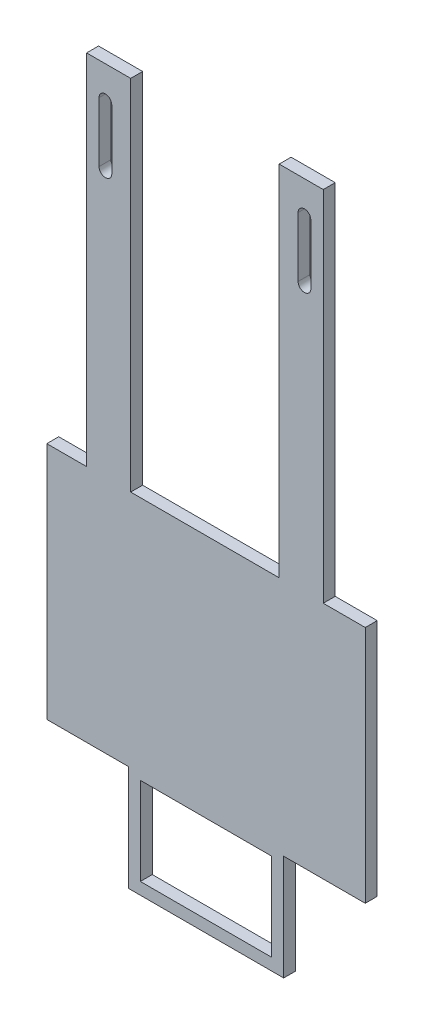
ISO-10303-21;
HEADER;
FILE_DESCRIPTION(('STEP AP214'),'2;1');
FILE_NAME('part.step','',(''),(''),'','','');
FILE_SCHEMA(('AUTOMOTIVE_DESIGN { 1 0 10303 214 1 1 1 1 }'));
ENDSEC;
DATA;
#1=APPLICATION_CONTEXT('core data for automotive mechanical design processes');
#2=APPLICATION_PROTOCOL_DEFINITION('international standard','automotive_design',2000,#1);
#3=PRODUCT_CONTEXT('',#1,'mechanical');
#4=PRODUCT('Part','Part','',(#3));
#5=PRODUCT_RELATED_PRODUCT_CATEGORY('part','',(#4));
#6=PRODUCT_DEFINITION_FORMATION('','',#4);
#7=PRODUCT_DEFINITION_CONTEXT('part definition',#1,'design');
#8=PRODUCT_DEFINITION('design','',#6,#7);
#9=PRODUCT_DEFINITION_SHAPE('','',#8);
#10=(LENGTH_UNIT() NAMED_UNIT(*) SI_UNIT(.MILLI.,.METRE.));
#11=(NAMED_UNIT(*) PLANE_ANGLE_UNIT() SI_UNIT($,.RADIAN.));
#12=(NAMED_UNIT(*) SI_UNIT($,.STERADIAN.) SOLID_ANGLE_UNIT());
#13=UNCERTAINTY_MEASURE_WITH_UNIT(LENGTH_MEASURE(1.E-05),#10,'distance_accuracy_value','');
#14=(GEOMETRIC_REPRESENTATION_CONTEXT(3) GLOBAL_UNCERTAINTY_ASSIGNED_CONTEXT((#13)) GLOBAL_UNIT_ASSIGNED_CONTEXT((#10,
#11,#12)) REPRESENTATION_CONTEXT('',''));
#15=CARTESIAN_POINT('',(0.,0.,0.));
#16=DIRECTION('',(0.,0.,1.));
#17=DIRECTION('',(1.,0.,0.));
#18=AXIS2_PLACEMENT_3D('',#15,#16,#17);
#19=CARTESIAN_POINT('',(0.,0.,3.));
#20=DIRECTION('',(0.,0.,-1.));
#21=DIRECTION('',(-1.,0.,0.));
#22=AXIS2_PLACEMENT_3D('',#19,#20,#21);
#23=PLANE('',#22);
#24=CARTESIAN_POINT('',(18.4511766992746,45.7315908599775,3.));
#25=DIRECTION('',(0.,0.,1.));
#26=DIRECTION('',(-1.,0.,0.));
#27=AXIS2_PLACEMENT_3D('',#24,#25,#26);
#28=CIRCLE('',#27,1.59999999999999);
#29=CARTESIAN_POINT('',(16.8511766992746,45.7315908599775,3.));
#30=VERTEX_POINT('',#29);
#31=CARTESIAN_POINT('',(20.0511766992746,45.7315908599775,3.));
#32=VERTEX_POINT('',#31);
#33=EDGE_CURVE('E279',#30,#32,#28,.T.);
#34=ORIENTED_EDGE('',*,*,#33,.F.);
#35=DIRECTION('',(0.,-1.,0.));
#36=VECTOR('',#35,1.);
#37=CARTESIAN_POINT('',(16.8511766992746,45.7315908599775,3.));
#38=LINE('',#37,#36);
#39=CARTESIAN_POINT('',(16.8511766992746,60.7315908599775,3.));
#40=VERTEX_POINT('',#39);
#41=EDGE_CURVE('E290',#40,#30,#38,.T.);
#42=ORIENTED_EDGE('',*,*,#41,.F.);
#43=CARTESIAN_POINT('',(18.4511766992746,60.7315908599775,3.));
#44=DIRECTION('',(0.,0.,1.));
#45=DIRECTION('',(-1.,0.,0.));
#46=AXIS2_PLACEMENT_3D('',#43,#44,#45);
#47=CIRCLE('',#46,1.6);
#48=CARTESIAN_POINT('',(20.0511766992746,60.7315908599775,3.));
#49=VERTEX_POINT('',#48);
#50=EDGE_CURVE('E286',#49,#40,#47,.T.);
#51=ORIENTED_EDGE('',*,*,#50,.F.);
#52=DIRECTION('',(0.,1.,0.));
#53=VECTOR('',#52,1.);
#54=CARTESIAN_POINT('',(20.0511766992746,45.7315908599775,3.));
#55=LINE('',#54,#53);
#56=EDGE_CURVE('E282',#32,#49,#55,.T.);
#57=ORIENTED_EDGE('',*,*,#56,.F.);
#58=EDGE_LOOP('',(#34,#42,#51,#57));
#59=FACE_BOUND('',#58,.T.);
#60=DIRECTION('',(1.,0.,0.));
#61=VECTOR('',#60,1.);
#62=CARTESIAN_POINT('',(13.227403860642,-81.1030863587574,3.));
#63=LINE('',#62,#61);
#64=CARTESIAN_POINT('',(13.227403860642,-81.1030863587574,3.));
#65=VERTEX_POINT('',#64);
#66=CARTESIAN_POINT('',(33.727403860642,-81.1030863587574,3.));
#67=VERTEX_POINT('',#66);
#68=EDGE_CURVE('E365',#65,#67,#63,.T.);
#69=ORIENTED_EDGE('',*,*,#68,.T.);
#70=DIRECTION('',(0.,1.,0.));
#71=VECTOR('',#70,1.);
#72=CARTESIAN_POINT('',(33.7274038606419,-21.1030863587574,3.));
#73=LINE('',#72,#71);
#74=CARTESIAN_POINT('',(33.7274038606419,-21.1030863587574,3.));
#75=VERTEX_POINT('',#74);
#76=EDGE_CURVE('E369',#67,#75,#73,.T.);
#77=ORIENTED_EDGE('',*,*,#76,.T.);
#78=DIRECTION('',(-1.,0.,0.));
#79=VECTOR('',#78,1.);
#80=CARTESIAN_POINT('',(23.1749495379073,-21.1030863587574,3.));
#81=LINE('',#80,#79);
#82=CARTESIAN_POINT('',(23.1749495379073,-21.1030863587574,3.));
#83=VERTEX_POINT('',#82);
#84=EDGE_CURVE('E373',#75,#83,#81,.T.);
#85=ORIENTED_EDGE('',*,*,#84,.T.);
#86=DIRECTION('',(0.,1.,0.));
#87=VECTOR('',#86,1.);
#88=CARTESIAN_POINT('',(23.1749495379073,68.8969136412426,3.));
#89=LINE('',#88,#87);
#90=CARTESIAN_POINT('',(23.1749495379073,68.8969136412426,3.));
#91=VERTEX_POINT('',#90);
#92=EDGE_CURVE('E376',#83,#91,#89,.T.);
#93=ORIENTED_EDGE('',*,*,#92,.T.);
#94=DIRECTION('',(-1.,0.,0.));
#95=VECTOR('',#94,1.);
#96=CARTESIAN_POINT('',(12.0979998474228,68.8969136412426,3.));
#97=LINE('',#96,#95);
#98=CARTESIAN_POINT('',(12.0979998474228,68.8969136412426,3.));
#99=VERTEX_POINT('',#98);
#100=EDGE_CURVE('E379',#91,#99,#97,.T.);
#101=ORIENTED_EDGE('',*,*,#100,.T.);
#102=DIRECTION('',(0.,-1.,0.));
#103=VECTOR('',#102,1.);
#104=CARTESIAN_POINT('',(12.0979998474228,68.8969136412426,3.));
#105=LINE('',#104,#103);
#106=CARTESIAN_POINT('',(12.0979998474228,-21.1030863587574,3.));
#107=VERTEX_POINT('',#106);
#108=EDGE_CURVE('E382',#99,#107,#105,.T.);
#109=ORIENTED_EDGE('',*,*,#108,.T.);
#110=DIRECTION('',(-1.,0.,0.));
#111=VECTOR('',#110,1.);
#112=CARTESIAN_POINT('',(-25.1956464488736,-21.1030863587574,3.));
#113=LINE('',#112,#111);
#114=CARTESIAN_POINT('',(-25.1956464488736,-21.1030863587574,3.));
#115=VERTEX_POINT('',#114);
#116=EDGE_CURVE('E385',#107,#115,#113,.T.);
#117=ORIENTED_EDGE('',*,*,#116,.T.);
#118=DIRECTION('',(0.,1.,0.));
#119=VECTOR('',#118,1.);
#120=CARTESIAN_POINT('',(-25.1956464488736,68.8969136412426,3.));
#121=LINE('',#120,#119);
#122=CARTESIAN_POINT('',(-25.1956464488736,68.8969136412426,3.));
#123=VERTEX_POINT('',#122);
#124=EDGE_CURVE('E388',#115,#123,#121,.T.);
#125=ORIENTED_EDGE('',*,*,#124,.T.);
#126=DIRECTION('',(-1.,0.,0.));
#127=VECTOR('',#126,1.);
#128=CARTESIAN_POINT('',(-36.2725961393581,68.8969136412426,3.));
#129=LINE('',#128,#127);
#130=CARTESIAN_POINT('',(-36.2725961393581,68.8969136412426,3.));
#131=VERTEX_POINT('',#130);
#132=EDGE_CURVE('E391',#123,#131,#129,.T.);
#133=ORIENTED_EDGE('',*,*,#132,.T.);
#134=DIRECTION('',(0.,-1.,0.));
#135=VECTOR('',#134,1.);
#136=CARTESIAN_POINT('',(-36.2725961393581,68.8969136412426,3.));
#137=LINE('',#136,#135);
#138=CARTESIAN_POINT('',(-36.2725961393581,-21.1030863587574,3.));
#139=VERTEX_POINT('',#138);
#140=EDGE_CURVE('E394',#131,#139,#137,.T.);
#141=ORIENTED_EDGE('',*,*,#140,.T.);
#142=DIRECTION('',(-1.,0.,0.));
#143=VECTOR('',#142,1.);
#144=CARTESIAN_POINT('',(-36.2725961393581,-21.1030863587574,3.));
#145=LINE('',#144,#143);
#146=CARTESIAN_POINT('',(-46.2725961393581,-21.1030863587574,3.));
#147=VERTEX_POINT('',#146);
#148=EDGE_CURVE('E397',#139,#147,#145,.T.);
#149=ORIENTED_EDGE('',*,*,#148,.T.);
#150=DIRECTION('',(0.,-1.,0.));
#151=VECTOR('',#150,1.);
#152=CARTESIAN_POINT('',(-46.2725961393581,-21.1030863587574,3.));
#153=LINE('',#152,#151);
#154=CARTESIAN_POINT('',(-46.272596139358,-81.1030863587574,3.));
#155=VERTEX_POINT('',#154);
#156=EDGE_CURVE('E400',#147,#155,#153,.T.);
#157=ORIENTED_EDGE('',*,*,#156,.T.);
#158=DIRECTION('',(1.,0.,0.));
#159=VECTOR('',#158,1.);
#160=CARTESIAN_POINT('',(-46.272596139358,-81.1030863587574,3.));
#161=LINE('',#160,#159);
#162=CARTESIAN_POINT('',(-25.772596139358,-81.1030863587574,3.));
#163=VERTEX_POINT('',#162);
#164=EDGE_CURVE('E403',#155,#163,#161,.T.);
#165=ORIENTED_EDGE('',*,*,#164,.T.);
#166=DIRECTION('',(0.,-1.,0.));
#167=VECTOR('',#166,1.);
#168=CARTESIAN_POINT('',(-25.772596139358,-81.1030863587574,3.));
#169=LINE('',#168,#167);
#170=CARTESIAN_POINT('',(-25.772596139358,-107.603086358757,3.));
#171=VERTEX_POINT('',#170);
#172=EDGE_CURVE('E406',#163,#171,#169,.T.);
#173=ORIENTED_EDGE('',*,*,#172,.T.);
#174=DIRECTION('',(1.,0.,0.));
#175=VECTOR('',#174,1.);
#176=CARTESIAN_POINT('',(-25.772596139358,-107.603086358757,3.));
#177=LINE('',#176,#175);
#178=CARTESIAN_POINT('',(13.227403860642,-107.603086358757,3.));
#179=VERTEX_POINT('',#178);
#180=EDGE_CURVE('E409',#171,#179,#177,.T.);
#181=ORIENTED_EDGE('',*,*,#180,.T.);
#182=DIRECTION('',(0.,1.,0.));
#183=VECTOR('',#182,1.);
#184=CARTESIAN_POINT('',(13.227403860642,-81.1030863587574,3.));
#185=LINE('',#184,#183);
#186=EDGE_CURVE('E412',#179,#65,#185,.T.);
#187=ORIENTED_EDGE('',*,*,#186,.T.);
#188=EDGE_LOOP('',(#69,#77,#85,#93,#101,#109,#117,#125,#133,#141,#149,#157,#165,#173,#181,#187));
#189=FACE_BOUND('',#188,.T.);
#190=CARTESIAN_POINT('',(-31.5488233007254,45.7315908599775,3.));
#191=DIRECTION('',(0.,0.,1.));
#192=DIRECTION('',(1.,0.,0.));
#193=AXIS2_PLACEMENT_3D('',#190,#191,#192);
#194=CIRCLE('',#193,1.59999999999999);
#195=CARTESIAN_POINT('',(-33.1488233007254,45.7315908599775,3.));
#196=VERTEX_POINT('',#195);
#197=CARTESIAN_POINT('',(-29.9488233007254,45.7315908599775,3.));
#198=VERTEX_POINT('',#197);
#199=EDGE_CURVE('E322',#196,#198,#194,.T.);
#200=ORIENTED_EDGE('',*,*,#199,.F.);
#201=DIRECTION('',(0.,-1.,0.));
#202=VECTOR('',#201,1.);
#203=CARTESIAN_POINT('',(-33.1488233007254,45.7315908599775,3.));
#204=LINE('',#203,#202);
#205=CARTESIAN_POINT('',(-33.1488233007254,60.7315908599775,3.));
#206=VERTEX_POINT('',#205);
#207=EDGE_CURVE('E333',#206,#196,#204,.T.);
#208=ORIENTED_EDGE('',*,*,#207,.F.);
#209=CARTESIAN_POINT('',(-31.5488233007254,60.7315908599775,3.));
#210=DIRECTION('',(0.,0.,1.));
#211=DIRECTION('',(1.,0.,0.));
#212=AXIS2_PLACEMENT_3D('',#209,#210,#211);
#213=CIRCLE('',#212,1.6);
#214=CARTESIAN_POINT('',(-29.9488233007254,60.7315908599775,3.));
#215=VERTEX_POINT('',#214);
#216=EDGE_CURVE('E329',#215,#206,#213,.T.);
#217=ORIENTED_EDGE('',*,*,#216,.F.);
#218=DIRECTION('',(0.,1.,0.));
#219=VECTOR('',#218,1.);
#220=CARTESIAN_POINT('',(-29.9488233007254,45.7315908599775,3.));
#221=LINE('',#220,#219);
#222=EDGE_CURVE('E325',#198,#215,#221,.T.);
#223=ORIENTED_EDGE('',*,*,#222,.F.);
#224=EDGE_LOOP('',(#200,#208,#217,#223));
#225=FACE_BOUND('',#224,.T.);
#226=DIRECTION('',(-1.,0.,0.));
#227=VECTOR('',#226,1.);
#228=CARTESIAN_POINT('',(-22.772596139358,-82.6030863587574,3.));
#229=LINE('',#228,#227);
#230=CARTESIAN_POINT('',(10.227403860642,-82.6030863587574,3.));
#231=VERTEX_POINT('',#230);
#232=CARTESIAN_POINT('',(-22.772596139358,-82.6030863587574,3.));
#233=VERTEX_POINT('',#232);
#234=EDGE_CURVE('E231',#231,#233,#229,.T.);
#235=ORIENTED_EDGE('',*,*,#234,.F.);
#236=DIRECTION('',(0.,1.,0.));
#237=VECTOR('',#236,1.);
#238=CARTESIAN_POINT('',(10.227403860642,-82.6030863587574,3.));
#239=LINE('',#238,#237);
#240=CARTESIAN_POINT('',(10.227403860642,-104.603086358757,3.));
#241=VERTEX_POINT('',#240);
#242=EDGE_CURVE('E257',#241,#231,#239,.T.);
#243=ORIENTED_EDGE('',*,*,#242,.F.);
#244=DIRECTION('',(1.,0.,0.));
#245=VECTOR('',#244,1.);
#246=CARTESIAN_POINT('',(-22.772596139358,-104.603086358757,3.));
#247=LINE('',#246,#245);
#248=CARTESIAN_POINT('',(-22.772596139358,-104.603086358757,3.));
#249=VERTEX_POINT('',#248);
#250=EDGE_CURVE('E253',#249,#241,#247,.T.);
#251=ORIENTED_EDGE('',*,*,#250,.F.);
#252=DIRECTION('',(0.,-1.,0.));
#253=VECTOR('',#252,1.);
#254=CARTESIAN_POINT('',(-22.772596139358,-82.6030863587574,3.));
#255=LINE('',#254,#253);
#256=EDGE_CURVE('E240',#233,#249,#255,.T.);
#257=ORIENTED_EDGE('',*,*,#256,.F.);
#258=EDGE_LOOP('',(#235,#243,#251,#257));
#259=FACE_BOUND('',#258,.T.);
#260=ADVANCED_FACE('F45',(#59,#189,#225,#259),#23,.F.);
#261=CARTESIAN_POINT('',(0.,0.,0.));
#262=DIRECTION('',(0.,0.,-1.));
#263=DIRECTION('',(-1.,0.,0.));
#264=AXIS2_PLACEMENT_3D('',#261,#262,#263);
#265=PLANE('',#264);
#266=DIRECTION('',(1.,0.,0.));
#267=VECTOR('',#266,1.);
#268=CARTESIAN_POINT('',(13.227403860642,-81.1030863587574,0.));
#269=LINE('',#268,#267);
#270=CARTESIAN_POINT('',(13.227403860642,-81.1030863587574,0.));
#271=VERTEX_POINT('',#270);
#272=CARTESIAN_POINT('',(33.727403860642,-81.1030863587574,0.));
#273=VERTEX_POINT('',#272);
#274=EDGE_CURVE('E364',#271,#273,#269,.T.);
#275=ORIENTED_EDGE('',*,*,#274,.F.);
#276=DIRECTION('',(0.,1.,0.));
#277=VECTOR('',#276,1.);
#278=CARTESIAN_POINT('',(13.227403860642,-81.1030863587574,0.));
#279=LINE('',#278,#277);
#280=CARTESIAN_POINT('',(13.227403860642,-107.603086358757,0.));
#281=VERTEX_POINT('',#280);
#282=EDGE_CURVE('E370',#281,#271,#279,.T.);
#283=ORIENTED_EDGE('',*,*,#282,.F.);
#284=DIRECTION('',(1.,0.,0.));
#285=VECTOR('',#284,1.);
#286=CARTESIAN_POINT('',(-25.772596139358,-107.603086358757,0.));
#287=LINE('',#286,#285);
#288=CARTESIAN_POINT('',(-25.772596139358,-107.603086358757,0.));
#289=VERTEX_POINT('',#288);
#290=EDGE_CURVE('E458',#289,#281,#287,.T.);
#291=ORIENTED_EDGE('',*,*,#290,.F.);
#292=DIRECTION('',(0.,-1.,0.));
#293=VECTOR('',#292,1.);
#294=CARTESIAN_POINT('',(-25.772596139358,-81.1030863587574,0.));
#295=LINE('',#294,#293);
#296=CARTESIAN_POINT('',(-25.772596139358,-81.1030863587574,0.));
#297=VERTEX_POINT('',#296);
#298=EDGE_CURVE('E455',#297,#289,#295,.T.);
#299=ORIENTED_EDGE('',*,*,#298,.F.);
#300=DIRECTION('',(1.,0.,0.));
#301=VECTOR('',#300,1.);
#302=CARTESIAN_POINT('',(-46.272596139358,-81.1030863587574,0.));
#303=LINE('',#302,#301);
#304=CARTESIAN_POINT('',(-46.272596139358,-81.1030863587574,0.));
#305=VERTEX_POINT('',#304);
#306=EDGE_CURVE('E452',#305,#297,#303,.T.);
#307=ORIENTED_EDGE('',*,*,#306,.F.);
#308=DIRECTION('',(0.,-1.,0.));
#309=VECTOR('',#308,1.);
#310=CARTESIAN_POINT('',(-46.2725961393581,-21.1030863587574,0.));
#311=LINE('',#310,#309);
#312=CARTESIAN_POINT('',(-46.2725961393581,-21.1030863587574,0.));
#313=VERTEX_POINT('',#312);
#314=EDGE_CURVE('E449',#313,#305,#311,.T.);
#315=ORIENTED_EDGE('',*,*,#314,.F.);
#316=DIRECTION('',(-1.,0.,0.));
#317=VECTOR('',#316,1.);
#318=CARTESIAN_POINT('',(-36.2725961393581,-21.1030863587574,0.));
#319=LINE('',#318,#317);
#320=CARTESIAN_POINT('',(-36.2725961393581,-21.1030863587574,0.));
#321=VERTEX_POINT('',#320);
#322=EDGE_CURVE('E446',#321,#313,#319,.T.);
#323=ORIENTED_EDGE('',*,*,#322,.F.);
#324=DIRECTION('',(0.,-1.,0.));
#325=VECTOR('',#324,1.);
#326=CARTESIAN_POINT('',(-36.2725961393581,68.8969136412426,0.));
#327=LINE('',#326,#325);
#328=CARTESIAN_POINT('',(-36.2725961393581,68.8969136412426,0.));
#329=VERTEX_POINT('',#328);
#330=EDGE_CURVE('E443',#329,#321,#327,.T.);
#331=ORIENTED_EDGE('',*,*,#330,.F.);
#332=DIRECTION('',(-1.,0.,0.));
#333=VECTOR('',#332,1.);
#334=CARTESIAN_POINT('',(-36.2725961393581,68.8969136412426,0.));
#335=LINE('',#334,#333);
#336=CARTESIAN_POINT('',(-25.1956464488736,68.8969136412426,0.));
#337=VERTEX_POINT('',#336);
#338=EDGE_CURVE('E440',#337,#329,#335,.T.);
#339=ORIENTED_EDGE('',*,*,#338,.F.);
#340=DIRECTION('',(0.,1.,0.));
#341=VECTOR('',#340,1.);
#342=CARTESIAN_POINT('',(-25.1956464488736,68.8969136412426,0.));
#343=LINE('',#342,#341);
#344=CARTESIAN_POINT('',(-25.1956464488736,-21.1030863587574,0.));
#345=VERTEX_POINT('',#344);
#346=EDGE_CURVE('E437',#345,#337,#343,.T.);
#347=ORIENTED_EDGE('',*,*,#346,.F.);
#348=DIRECTION('',(-1.,0.,0.));
#349=VECTOR('',#348,1.);
#350=CARTESIAN_POINT('',(-25.1956464488736,-21.1030863587574,0.));
#351=LINE('',#350,#349);
#352=CARTESIAN_POINT('',(12.0979998474228,-21.1030863587574,0.));
#353=VERTEX_POINT('',#352);
#354=EDGE_CURVE('E434',#353,#345,#351,.T.);
#355=ORIENTED_EDGE('',*,*,#354,.F.);
#356=DIRECTION('',(0.,-1.,0.));
#357=VECTOR('',#356,1.);
#358=CARTESIAN_POINT('',(12.0979998474228,68.8969136412426,0.));
#359=LINE('',#358,#357);
#360=CARTESIAN_POINT('',(12.0979998474228,68.8969136412426,0.));
#361=VERTEX_POINT('',#360);
#362=EDGE_CURVE('E431',#361,#353,#359,.T.);
#363=ORIENTED_EDGE('',*,*,#362,.F.);
#364=DIRECTION('',(-1.,0.,0.));
#365=VECTOR('',#364,1.);
#366=CARTESIAN_POINT('',(12.0979998474228,68.8969136412426,0.));
#367=LINE('',#366,#365);
#368=CARTESIAN_POINT('',(23.1749495379073,68.8969136412426,0.));
#369=VERTEX_POINT('',#368);
#370=EDGE_CURVE('E428',#369,#361,#367,.T.);
#371=ORIENTED_EDGE('',*,*,#370,.F.);
#372=DIRECTION('',(0.,1.,0.));
#373=VECTOR('',#372,1.);
#374=CARTESIAN_POINT('',(23.1749495379073,68.8969136412426,0.));
#375=LINE('',#374,#373);
#376=CARTESIAN_POINT('',(23.1749495379073,-21.1030863587574,0.));
#377=VERTEX_POINT('',#376);
#378=EDGE_CURVE('E425',#377,#369,#375,.T.);
#379=ORIENTED_EDGE('',*,*,#378,.F.);
#380=DIRECTION('',(-1.,0.,0.));
#381=VECTOR('',#380,1.);
#382=CARTESIAN_POINT('',(23.1749495379073,-21.1030863587574,0.));
#383=LINE('',#382,#381);
#384=CARTESIAN_POINT('',(33.7274038606419,-21.1030863587574,0.));
#385=VERTEX_POINT('',#384);
#386=EDGE_CURVE('E422',#385,#377,#383,.T.);
#387=ORIENTED_EDGE('',*,*,#386,.F.);
#388=DIRECTION('',(0.,1.,0.));
#389=VECTOR('',#388,1.);
#390=CARTESIAN_POINT('',(33.7274038606419,-21.1030863587574,0.));
#391=LINE('',#390,#389);
#392=EDGE_CURVE('E419',#273,#385,#391,.T.);
#393=ORIENTED_EDGE('',*,*,#392,.F.);
#394=EDGE_LOOP('',(#275,#283,#291,#299,#307,#315,#323,#331,#339,#347,#355,#363,#371,#379,#387,#393));
#395=FACE_BOUND('',#394,.T.);
#396=DIRECTION('',(0.,-1.,0.));
#397=VECTOR('',#396,1.);
#398=CARTESIAN_POINT('',(-33.1488233007254,45.7315908599775,0.));
#399=LINE('',#398,#397);
#400=CARTESIAN_POINT('',(-33.1488233007254,60.7315908599775,0.));
#401=VERTEX_POINT('',#400);
#402=CARTESIAN_POINT('',(-33.1488233007254,45.7315908599775,0.));
#403=VERTEX_POINT('',#402);
#404=EDGE_CURVE('E326',#401,#403,#399,.T.);
#405=ORIENTED_EDGE('',*,*,#404,.T.);
#406=CARTESIAN_POINT('',(-31.5488233007254,45.7315908599775,0.));
#407=DIRECTION('',(0.,0.,1.));
#408=DIRECTION('',(1.,0.,0.));
#409=AXIS2_PLACEMENT_3D('',#406,#407,#408);
#410=CIRCLE('',#409,1.59999999999999);
#411=CARTESIAN_POINT('',(-29.9488233007254,45.7315908599775,0.));
#412=VERTEX_POINT('',#411);
#413=EDGE_CURVE('E321',#403,#412,#410,.T.);
#414=ORIENTED_EDGE('',*,*,#413,.T.);
#415=DIRECTION('',(0.,1.,0.));
#416=VECTOR('',#415,1.);
#417=CARTESIAN_POINT('',(-29.9488233007254,45.7315908599775,0.));
#418=LINE('',#417,#416);
#419=CARTESIAN_POINT('',(-29.9488233007254,60.7315908599775,0.));
#420=VERTEX_POINT('',#419);
#421=EDGE_CURVE('E340',#412,#420,#418,.T.);
#422=ORIENTED_EDGE('',*,*,#421,.T.);
#423=CARTESIAN_POINT('',(-31.5488233007254,60.7315908599775,0.));
#424=DIRECTION('',(0.,0.,1.));
#425=DIRECTION('',(1.,0.,0.));
#426=AXIS2_PLACEMENT_3D('',#423,#424,#425);
#427=CIRCLE('',#426,1.6);
#428=EDGE_CURVE('E344',#420,#401,#427,.T.);
#429=ORIENTED_EDGE('',*,*,#428,.T.);
#430=EDGE_LOOP('',(#405,#414,#422,#429));
#431=FACE_BOUND('',#430,.T.);
#432=DIRECTION('',(0.,-1.,0.));
#433=VECTOR('',#432,1.);
#434=CARTESIAN_POINT('',(16.8511766992746,45.7315908599775,0.));
#435=LINE('',#434,#433);
#436=CARTESIAN_POINT('',(16.8511766992746,60.7315908599775,0.));
#437=VERTEX_POINT('',#436);
#438=CARTESIAN_POINT('',(16.8511766992746,45.7315908599775,0.));
#439=VERTEX_POINT('',#438);
#440=EDGE_CURVE('E283',#437,#439,#435,.T.);
#441=ORIENTED_EDGE('',*,*,#440,.T.);
#442=CARTESIAN_POINT('',(18.4511766992746,45.7315908599775,0.));
#443=DIRECTION('',(0.,0.,1.));
#444=DIRECTION('',(-1.,0.,0.));
#445=AXIS2_PLACEMENT_3D('',#442,#443,#444);
#446=CIRCLE('',#445,1.59999999999999);
#447=CARTESIAN_POINT('',(20.0511766992746,45.7315908599775,0.));
#448=VERTEX_POINT('',#447);
#449=EDGE_CURVE('E249',#439,#448,#446,.T.);
#450=ORIENTED_EDGE('',*,*,#449,.T.);
#451=DIRECTION('',(0.,1.,0.));
#452=VECTOR('',#451,1.);
#453=CARTESIAN_POINT('',(20.0511766992746,45.7315908599775,0.));
#454=LINE('',#453,#452);
#455=CARTESIAN_POINT('',(20.0511766992746,60.7315908599775,0.));
#456=VERTEX_POINT('',#455);
#457=EDGE_CURVE('E297',#448,#456,#454,.T.);
#458=ORIENTED_EDGE('',*,*,#457,.T.);
#459=CARTESIAN_POINT('',(18.4511766992746,60.7315908599775,0.));
#460=DIRECTION('',(0.,0.,1.));
#461=DIRECTION('',(-1.,0.,0.));
#462=AXIS2_PLACEMENT_3D('',#459,#460,#461);
#463=CIRCLE('',#462,1.6);
#464=EDGE_CURVE('E301',#456,#437,#463,.T.);
#465=ORIENTED_EDGE('',*,*,#464,.T.);
#466=EDGE_LOOP('',(#441,#450,#458,#465));
#467=FACE_BOUND('',#466,.T.);
#468=DIRECTION('',(0.,1.,0.));
#469=VECTOR('',#468,1.);
#470=CARTESIAN_POINT('',(10.227403860642,-82.6030863587574,0.));
#471=LINE('',#470,#469);
#472=CARTESIAN_POINT('',(10.227403860642,-104.603086358757,0.));
#473=VERTEX_POINT('',#472);
#474=CARTESIAN_POINT('',(10.227403860642,-82.6030863587574,0.));
#475=VERTEX_POINT('',#474);
#476=EDGE_CURVE('E241',#473,#475,#471,.T.);
#477=ORIENTED_EDGE('',*,*,#476,.T.);
#478=DIRECTION('',(-1.,0.,0.));
#479=VECTOR('',#478,1.);
#480=CARTESIAN_POINT('',(-22.772596139358,-82.6030863587574,0.));
#481=LINE('',#480,#479);
#482=CARTESIAN_POINT('',(-22.772596139358,-82.6030863587574,0.));
#483=VERTEX_POINT('',#482);
#484=EDGE_CURVE('E69',#475,#483,#481,.T.);
#485=ORIENTED_EDGE('',*,*,#484,.T.);
#486=DIRECTION('',(0.,-1.,0.));
#487=VECTOR('',#486,1.);
#488=CARTESIAN_POINT('',(-22.772596139358,-82.6030863587574,0.));
#489=LINE('',#488,#487);
#490=CARTESIAN_POINT('',(-22.772596139358,-104.603086358757,0.));
#491=VERTEX_POINT('',#490);
#492=EDGE_CURVE('E247',#483,#491,#489,.T.);
#493=ORIENTED_EDGE('',*,*,#492,.T.);
#494=DIRECTION('',(1.,0.,0.));
#495=VECTOR('',#494,1.);
#496=CARTESIAN_POINT('',(-22.772596139358,-104.603086358757,0.));
#497=LINE('',#496,#495);
#498=EDGE_CURVE('E266',#491,#473,#497,.T.);
#499=ORIENTED_EDGE('',*,*,#498,.T.);
#500=EDGE_LOOP('',(#477,#485,#493,#499));
#501=FACE_BOUND('',#500,.T.);
#502=ADVANCED_FACE('F529',(#395,#431,#467,#501),#265,.T.);
#503=CARTESIAN_POINT('',(13.227403860642,-81.1030863587574,3.));
#504=DIRECTION('',(0.,1.,0.));
#505=DIRECTION('',(0.,0.,1.));
#506=AXIS2_PLACEMENT_3D('',#503,#504,#505);
#507=PLANE('',#506);
#508=ORIENTED_EDGE('',*,*,#274,.T.);
#509=DIRECTION('',(0.,0.,-1.));
#510=VECTOR('',#509,1.);
#511=CARTESIAN_POINT('',(33.727403860642,-81.1030863587574,3.));
#512=LINE('',#511,#510);
#513=EDGE_CURVE('E11',#67,#273,#512,.T.);
#514=ORIENTED_EDGE('',*,*,#513,.F.);
#515=ORIENTED_EDGE('',*,*,#68,.F.);
#516=DIRECTION('',(0.,0.,-1.));
#517=VECTOR('',#516,1.);
#518=CARTESIAN_POINT('',(13.227403860642,-81.1030863587574,3.));
#519=LINE('',#518,#517);
#520=EDGE_CURVE('E415',#65,#271,#519,.T.);
#521=ORIENTED_EDGE('',*,*,#520,.T.);
#522=EDGE_LOOP('',(#508,#514,#515,#521));
#523=FACE_BOUND('',#522,.T.);
#524=ADVANCED_FACE('F47',(#523),#507,.F.);
#525=CARTESIAN_POINT('',(33.7274038606419,-21.1030863587574,3.));
#526=DIRECTION('',(-1.,0.,0.));
#527=DIRECTION('',(0.,-1.,0.));
#528=AXIS2_PLACEMENT_3D('',#525,#526,#527);
#529=PLANE('',#528);
#530=ORIENTED_EDGE('',*,*,#392,.T.);
#531=DIRECTION('',(0.,0.,-1.));
#532=VECTOR('',#531,1.);
#533=CARTESIAN_POINT('',(33.7274038606419,-21.1030863587574,3.));
#534=LINE('',#533,#532);
#535=EDGE_CURVE('E54',#75,#385,#534,.T.);
#536=ORIENTED_EDGE('',*,*,#535,.F.);
#537=ORIENTED_EDGE('',*,*,#76,.F.);
#538=ORIENTED_EDGE('',*,*,#513,.T.);
#539=EDGE_LOOP('',(#530,#536,#537,#538));
#540=FACE_BOUND('',#539,.T.);
#541=ADVANCED_FACE('F547',(#540),#529,.F.);
#542=CARTESIAN_POINT('',(23.1749495379073,-21.1030863587574,3.));
#543=DIRECTION('',(0.,-1.,0.));
#544=DIRECTION('',(1.,0.,0.));
#545=AXIS2_PLACEMENT_3D('',#542,#543,#544);
#546=PLANE('',#545);
#547=ORIENTED_EDGE('',*,*,#386,.T.);
#548=DIRECTION('',(0.,0.,-1.));
#549=VECTOR('',#548,1.);
#550=CARTESIAN_POINT('',(23.1749495379073,-21.1030863587574,3.));
#551=LINE('',#550,#549);
#552=EDGE_CURVE('E514',#83,#377,#551,.T.);
#553=ORIENTED_EDGE('',*,*,#552,.F.);
#554=ORIENTED_EDGE('',*,*,#84,.F.);
#555=ORIENTED_EDGE('',*,*,#535,.T.);
#556=EDGE_LOOP('',(#547,#553,#554,#555));
#557=FACE_BOUND('',#556,.T.);
#558=ADVANCED_FACE('F523',(#557),#546,.F.);
#559=CARTESIAN_POINT('',(23.1749495379073,68.8969136412426,3.));
#560=DIRECTION('',(-1.,0.,0.));
#561=DIRECTION('',(0.,0.,1.));
#562=AXIS2_PLACEMENT_3D('',#559,#560,#561);
#563=PLANE('',#562);
#564=ORIENTED_EDGE('',*,*,#378,.T.);
#565=DIRECTION('',(0.,0.,-1.));
#566=VECTOR('',#565,1.);
#567=CARTESIAN_POINT('',(23.1749495379073,68.8969136412426,3.));
#568=LINE('',#567,#566);
#569=EDGE_CURVE('E510',#91,#369,#568,.T.);
#570=ORIENTED_EDGE('',*,*,#569,.F.);
#571=ORIENTED_EDGE('',*,*,#92,.F.);
#572=ORIENTED_EDGE('',*,*,#552,.T.);
#573=EDGE_LOOP('',(#564,#570,#571,#572));
#574=FACE_BOUND('',#573,.T.);
#575=ADVANCED_FACE('F535',(#574),#563,.F.);
#576=CARTESIAN_POINT('',(12.0979998474228,68.8969136412426,3.));
#577=DIRECTION('',(0.,-1.,0.));
#578=DIRECTION('',(1.,0.,0.));
#579=AXIS2_PLACEMENT_3D('',#576,#577,#578);
#580=PLANE('',#579);
#581=ORIENTED_EDGE('',*,*,#370,.T.);
#582=DIRECTION('',(0.,0.,-1.));
#583=VECTOR('',#582,1.);
#584=CARTESIAN_POINT('',(12.0979998474228,68.8969136412426,3.));
#585=LINE('',#584,#583);
#586=EDGE_CURVE('E506',#99,#361,#585,.T.);
#587=ORIENTED_EDGE('',*,*,#586,.F.);
#588=ORIENTED_EDGE('',*,*,#100,.F.);
#589=ORIENTED_EDGE('',*,*,#569,.T.);
#590=EDGE_LOOP('',(#581,#587,#588,#589));
#591=FACE_BOUND('',#590,.T.);
#592=ADVANCED_FACE('F539',(#591),#580,.F.);
#593=CARTESIAN_POINT('',(12.0979998474228,68.8969136412426,3.));
#594=DIRECTION('',(1.,0.,0.));
#595=DIRECTION('',(0.,1.,0.));
#596=AXIS2_PLACEMENT_3D('',#593,#594,#595);
#597=PLANE('',#596);
#598=ORIENTED_EDGE('',*,*,#362,.T.);
#599=DIRECTION('',(0.,0.,-1.));
#600=VECTOR('',#599,1.);
#601=CARTESIAN_POINT('',(12.0979998474228,-21.1030863587574,3.));
#602=LINE('',#601,#600);
#603=EDGE_CURVE('E502',#107,#353,#602,.T.);
#604=ORIENTED_EDGE('',*,*,#603,.F.);
#605=ORIENTED_EDGE('',*,*,#108,.F.);
#606=ORIENTED_EDGE('',*,*,#586,.T.);
#607=EDGE_LOOP('',(#598,#604,#605,#606));
#608=FACE_BOUND('',#607,.T.);
#609=ADVANCED_FACE('F600',(#608),#597,.F.);
#610=CARTESIAN_POINT('',(-25.1956464488736,-21.1030863587574,3.));
#611=DIRECTION('',(0.,-1.,0.));
#612=DIRECTION('',(1.,0.,0.));
#613=AXIS2_PLACEMENT_3D('',#610,#611,#612);
#614=PLANE('',#613);
#615=ORIENTED_EDGE('',*,*,#354,.T.);
#616=DIRECTION('',(0.,0.,-1.));
#617=VECTOR('',#616,1.);
#618=CARTESIAN_POINT('',(-25.1956464488736,-21.1030863587574,3.));
#619=LINE('',#618,#617);
#620=EDGE_CURVE('E498',#115,#345,#619,.T.);
#621=ORIENTED_EDGE('',*,*,#620,.F.);
#622=ORIENTED_EDGE('',*,*,#116,.F.);
#623=ORIENTED_EDGE('',*,*,#603,.T.);
#624=EDGE_LOOP('',(#615,#621,#622,#623));
#625=FACE_BOUND('',#624,.T.);
#626=ADVANCED_FACE('F597',(#625),#614,.F.);
#627=CARTESIAN_POINT('',(-25.1956464488736,68.8969136412426,3.));
#628=DIRECTION('',(-1.,0.,0.));
#629=DIRECTION('',(0.,-1.,0.));
#630=AXIS2_PLACEMENT_3D('',#627,#628,#629);
#631=PLANE('',#630);
#632=ORIENTED_EDGE('',*,*,#346,.T.);
#633=DIRECTION('',(0.,0.,-1.));
#634=VECTOR('',#633,1.);
#635=CARTESIAN_POINT('',(-25.1956464488736,68.8969136412426,3.));
#636=LINE('',#635,#634);
#637=EDGE_CURVE('E494',#123,#337,#636,.T.);
#638=ORIENTED_EDGE('',*,*,#637,.F.);
#639=ORIENTED_EDGE('',*,*,#124,.F.);
#640=ORIENTED_EDGE('',*,*,#620,.T.);
#641=EDGE_LOOP('',(#632,#638,#639,#640));
#642=FACE_BOUND('',#641,.T.);
#643=ADVANCED_FACE('F593',(#642),#631,.F.);
#644=CARTESIAN_POINT('',(-36.2725961393581,68.8969136412426,3.));
#645=DIRECTION('',(0.,-1.,0.));
#646=DIRECTION('',(0.,0.,-1.));
#647=AXIS2_PLACEMENT_3D('',#644,#645,#646);
#648=PLANE('',#647);
#649=ORIENTED_EDGE('',*,*,#338,.T.);
#650=DIRECTION('',(0.,0.,-1.));
#651=VECTOR('',#650,1.);
#652=CARTESIAN_POINT('',(-36.2725961393581,68.8969136412426,3.));
#653=LINE('',#652,#651);
#654=EDGE_CURVE('E490',#131,#329,#653,.T.);
#655=ORIENTED_EDGE('',*,*,#654,.F.);
#656=ORIENTED_EDGE('',*,*,#132,.F.);
#657=ORIENTED_EDGE('',*,*,#637,.T.);
#658=EDGE_LOOP('',(#649,#655,#656,#657));
#659=FACE_BOUND('',#658,.T.);
#660=ADVANCED_FACE('F589',(#659),#648,.F.);
#661=CARTESIAN_POINT('',(-36.2725961393581,68.8969136412426,3.));
#662=DIRECTION('',(1.,0.,0.));
#663=DIRECTION('',(0.,1.,0.));
#664=AXIS2_PLACEMENT_3D('',#661,#662,#663);
#665=PLANE('',#664);
#666=ORIENTED_EDGE('',*,*,#330,.T.);
#667=DIRECTION('',(0.,0.,-1.));
#668=VECTOR('',#667,1.);
#669=CARTESIAN_POINT('',(-36.2725961393581,-21.1030863587574,3.));
#670=LINE('',#669,#668);
#671=EDGE_CURVE('E486',#139,#321,#670,.T.);
#672=ORIENTED_EDGE('',*,*,#671,.F.);
#673=ORIENTED_EDGE('',*,*,#140,.F.);
#674=ORIENTED_EDGE('',*,*,#654,.T.);
#675=EDGE_LOOP('',(#666,#672,#673,#674));
#676=FACE_BOUND('',#675,.T.);
#677=ADVANCED_FACE('F584',(#676),#665,.F.);
#678=CARTESIAN_POINT('',(-36.2725961393581,-21.1030863587574,3.));
#679=DIRECTION('',(0.,-1.,0.));
#680=DIRECTION('',(0.,0.,-1.));
#681=AXIS2_PLACEMENT_3D('',#678,#679,#680);
#682=PLANE('',#681);
#683=ORIENTED_EDGE('',*,*,#322,.T.);
#684=DIRECTION('',(0.,0.,-1.));
#685=VECTOR('',#684,1.);
#686=CARTESIAN_POINT('',(-46.2725961393581,-21.1030863587574,3.));
#687=LINE('',#686,#685);
#688=EDGE_CURVE('E482',#147,#313,#687,.T.);
#689=ORIENTED_EDGE('',*,*,#688,.F.);
#690=ORIENTED_EDGE('',*,*,#148,.F.);
#691=ORIENTED_EDGE('',*,*,#671,.T.);
#692=EDGE_LOOP('',(#683,#689,#690,#691));
#693=FACE_BOUND('',#692,.T.);
#694=ADVANCED_FACE('F578',(#693),#682,.F.);
#695=CARTESIAN_POINT('',(-46.2725961393581,-21.1030863587574,3.));
#696=DIRECTION('',(1.,0.,0.));
#697=DIRECTION('',(0.,1.,0.));
#698=AXIS2_PLACEMENT_3D('',#695,#696,#697);
#699=PLANE('',#698);
#700=ORIENTED_EDGE('',*,*,#314,.T.);
#701=DIRECTION('',(0.,0.,-1.));
#702=VECTOR('',#701,1.);
#703=CARTESIAN_POINT('',(-46.272596139358,-81.1030863587574,3.));
#704=LINE('',#703,#702);
#705=EDGE_CURVE('E478',#155,#305,#704,.T.);
#706=ORIENTED_EDGE('',*,*,#705,.F.);
#707=ORIENTED_EDGE('',*,*,#156,.F.);
#708=ORIENTED_EDGE('',*,*,#688,.T.);
#709=EDGE_LOOP('',(#700,#706,#707,#708));
#710=FACE_BOUND('',#709,.T.);
#711=ADVANCED_FACE('F574',(#710),#699,.F.);
#712=CARTESIAN_POINT('',(-46.272596139358,-81.1030863587574,3.));
#713=DIRECTION('',(0.,1.,0.));
#714=DIRECTION('',(0.,0.,1.));
#715=AXIS2_PLACEMENT_3D('',#712,#713,#714);
#716=PLANE('',#715);
#717=ORIENTED_EDGE('',*,*,#306,.T.);
#718=DIRECTION('',(0.,0.,-1.));
#719=VECTOR('',#718,1.);
#720=CARTESIAN_POINT('',(-25.772596139358,-81.1030863587574,3.));
#721=LINE('',#720,#719);
#722=EDGE_CURVE('E474',#163,#297,#721,.T.);
#723=ORIENTED_EDGE('',*,*,#722,.F.);
#724=ORIENTED_EDGE('',*,*,#164,.F.);
#725=ORIENTED_EDGE('',*,*,#705,.T.);
#726=EDGE_LOOP('',(#717,#723,#724,#725));
#727=FACE_BOUND('',#726,.T.);
#728=ADVANCED_FACE('F569',(#727),#716,.F.);
#729=CARTESIAN_POINT('',(-25.772596139358,-81.1030863587574,3.));
#730=DIRECTION('',(1.,0.,0.));
#731=DIRECTION('',(0.,0.,-1.));
#732=AXIS2_PLACEMENT_3D('',#729,#730,#731);
#733=PLANE('',#732);
#734=ORIENTED_EDGE('',*,*,#298,.T.);
#735=DIRECTION('',(0.,0.,-1.));
#736=VECTOR('',#735,1.);
#737=CARTESIAN_POINT('',(-25.772596139358,-107.603086358757,3.));
#738=LINE('',#737,#736);
#739=EDGE_CURVE('E470',#171,#289,#738,.T.);
#740=ORIENTED_EDGE('',*,*,#739,.F.);
#741=ORIENTED_EDGE('',*,*,#172,.F.);
#742=ORIENTED_EDGE('',*,*,#722,.T.);
#743=EDGE_LOOP('',(#734,#740,#741,#742));
#744=FACE_BOUND('',#743,.T.);
#745=ADVANCED_FACE('F563',(#744),#733,.F.);
#746=CARTESIAN_POINT('',(-25.772596139358,-107.603086358757,3.));
#747=DIRECTION('',(0.,1.,0.));
#748=DIRECTION('',(0.,0.,1.));
#749=AXIS2_PLACEMENT_3D('',#746,#747,#748);
#750=PLANE('',#749);
#751=ORIENTED_EDGE('',*,*,#290,.T.);
#752=DIRECTION('',(0.,0.,-1.));
#753=VECTOR('',#752,1.);
#754=CARTESIAN_POINT('',(13.227403860642,-107.603086358757,3.));
#755=LINE('',#754,#753);
#756=EDGE_CURVE('E466',#179,#281,#755,.T.);
#757=ORIENTED_EDGE('',*,*,#756,.F.);
#758=ORIENTED_EDGE('',*,*,#180,.F.);
#759=ORIENTED_EDGE('',*,*,#739,.T.);
#760=EDGE_LOOP('',(#751,#757,#758,#759));
#761=FACE_BOUND('',#760,.T.);
#762=ADVANCED_FACE('F559',(#761),#750,.F.);
#763=CARTESIAN_POINT('',(13.227403860642,-81.1030863587574,3.));
#764=DIRECTION('',(-1.,0.,0.));
#765=DIRECTION('',(0.,-1.,0.));
#766=AXIS2_PLACEMENT_3D('',#763,#764,#765);
#767=PLANE('',#766);
#768=ORIENTED_EDGE('',*,*,#282,.T.);
#769=ORIENTED_EDGE('',*,*,#520,.F.);
#770=ORIENTED_EDGE('',*,*,#186,.F.);
#771=ORIENTED_EDGE('',*,*,#756,.T.);
#772=EDGE_LOOP('',(#768,#769,#770,#771));
#773=FACE_BOUND('',#772,.T.);
#774=ADVANCED_FACE('F554',(#773),#767,.F.);
#775=CARTESIAN_POINT('',(-31.5488233007254,45.7315908599775,3.));
#776=DIRECTION('',(0.,0.,-1.));
#777=DIRECTION('',(-1.,0.,0.));
#778=AXIS2_PLACEMENT_3D('',#775,#776,#777);
#779=CYLINDRICAL_SURFACE('',#778,1.59999999999999);
#780=ORIENTED_EDGE('',*,*,#413,.F.);
#781=DIRECTION('',(0.,0.,-1.));
#782=VECTOR('',#781,1.);
#783=CARTESIAN_POINT('',(-33.1488233007254,45.7315908599775,3.));
#784=LINE('',#783,#782);
#785=EDGE_CURVE('E336',#196,#403,#784,.T.);
#786=ORIENTED_EDGE('',*,*,#785,.F.);
#787=ORIENTED_EDGE('',*,*,#199,.T.);
#788=DIRECTION('',(0.,0.,-1.));
#789=VECTOR('',#788,1.);
#790=CARTESIAN_POINT('',(-29.9488233007254,45.7315908599775,3.));
#791=LINE('',#790,#789);
#792=EDGE_CURVE('E360',#198,#412,#791,.T.);
#793=ORIENTED_EDGE('',*,*,#792,.T.);
#794=EDGE_LOOP('',(#780,#786,#787,#793));
#795=FACE_BOUND('',#794,.T.);
#796=ADVANCED_FACE('F618',(#795),#779,.F.);
#797=CARTESIAN_POINT('',(-29.9488233007254,45.7315908599775,3.));
#798=DIRECTION('',(-1.,0.,0.));
#799=DIRECTION('',(0.,-1.,0.));
#800=AXIS2_PLACEMENT_3D('',#797,#798,#799);
#801=PLANE('',#800);
#802=ORIENTED_EDGE('',*,*,#421,.F.);
#803=ORIENTED_EDGE('',*,*,#792,.F.);
#804=ORIENTED_EDGE('',*,*,#222,.T.);
#805=DIRECTION('',(0.,0.,-1.));
#806=VECTOR('',#805,1.);
#807=CARTESIAN_POINT('',(-29.9488233007254,60.7315908599775,3.));
#808=LINE('',#807,#806);
#809=EDGE_CURVE('E357',#215,#420,#808,.T.);
#810=ORIENTED_EDGE('',*,*,#809,.T.);
#811=EDGE_LOOP('',(#802,#803,#804,#810));
#812=FACE_BOUND('',#811,.T.);
#813=ADVANCED_FACE('F689',(#812),#801,.T.);
#814=CARTESIAN_POINT('',(-31.5488233007254,60.7315908599775,3.));
#815=DIRECTION('',(0.,0.,-1.));
#816=DIRECTION('',(-1.,0.,0.));
#817=AXIS2_PLACEMENT_3D('',#814,#815,#816);
#818=CYLINDRICAL_SURFACE('',#817,1.6);
#819=ORIENTED_EDGE('',*,*,#428,.F.);
#820=ORIENTED_EDGE('',*,*,#809,.F.);
#821=ORIENTED_EDGE('',*,*,#216,.T.);
#822=DIRECTION('',(0.,0.,-1.));
#823=VECTOR('',#822,1.);
#824=CARTESIAN_POINT('',(-33.1488233007254,60.7315908599775,3.));
#825=LINE('',#824,#823);
#826=EDGE_CURVE('E354',#206,#401,#825,.T.);
#827=ORIENTED_EDGE('',*,*,#826,.T.);
#828=EDGE_LOOP('',(#819,#820,#821,#827));
#829=FACE_BOUND('',#828,.T.);
#830=ADVANCED_FACE('F697',(#829),#818,.F.);
#831=CARTESIAN_POINT('',(-33.1488233007254,45.7315908599775,3.));
#832=DIRECTION('',(1.,0.,0.));
#833=DIRECTION('',(0.,0.,-1.));
#834=AXIS2_PLACEMENT_3D('',#831,#832,#833);
#835=PLANE('',#834);
#836=ORIENTED_EDGE('',*,*,#404,.F.);
#837=ORIENTED_EDGE('',*,*,#826,.F.);
#838=ORIENTED_EDGE('',*,*,#207,.T.);
#839=ORIENTED_EDGE('',*,*,#785,.T.);
#840=EDGE_LOOP('',(#836,#837,#838,#839));
#841=FACE_BOUND('',#840,.T.);
#842=ADVANCED_FACE('F705',(#841),#835,.T.);
#843=CARTESIAN_POINT('',(18.4511766992746,45.7315908599775,3.));
#844=DIRECTION('',(0.,0.,-1.));
#845=DIRECTION('',(-1.,0.,0.));
#846=AXIS2_PLACEMENT_3D('',#843,#844,#845);
#847=CYLINDRICAL_SURFACE('',#846,1.59999999999999);
#848=ORIENTED_EDGE('',*,*,#449,.F.);
#849=DIRECTION('',(0.,0.,-1.));
#850=VECTOR('',#849,1.);
#851=CARTESIAN_POINT('',(16.8511766992746,45.7315908599775,3.));
#852=LINE('',#851,#850);
#853=EDGE_CURVE('E293',#30,#439,#852,.T.);
#854=ORIENTED_EDGE('',*,*,#853,.F.);
#855=ORIENTED_EDGE('',*,*,#33,.T.);
#856=DIRECTION('',(0.,0.,-1.));
#857=VECTOR('',#856,1.);
#858=CARTESIAN_POINT('',(20.0511766992746,45.7315908599775,3.));
#859=LINE('',#858,#857);
#860=EDGE_CURVE('E317',#32,#448,#859,.T.);
#861=ORIENTED_EDGE('',*,*,#860,.T.);
#862=EDGE_LOOP('',(#848,#854,#855,#861));
#863=FACE_BOUND('',#862,.T.);
#864=ADVANCED_FACE('F714',(#863),#847,.F.);
#865=CARTESIAN_POINT('',(20.0511766992746,45.7315908599775,3.));
#866=DIRECTION('',(-1.,0.,0.));
#867=DIRECTION('',(0.,0.,1.));
#868=AXIS2_PLACEMENT_3D('',#865,#866,#867);
#869=PLANE('',#868);
#870=ORIENTED_EDGE('',*,*,#457,.F.);
#871=ORIENTED_EDGE('',*,*,#860,.F.);
#872=ORIENTED_EDGE('',*,*,#56,.T.);
#873=DIRECTION('',(0.,0.,-1.));
#874=VECTOR('',#873,1.);
#875=CARTESIAN_POINT('',(20.0511766992746,60.7315908599775,3.));
#876=LINE('',#875,#874);
#877=EDGE_CURVE('E314',#49,#456,#876,.T.);
#878=ORIENTED_EDGE('',*,*,#877,.T.);
#879=EDGE_LOOP('',(#870,#871,#872,#878));
#880=FACE_BOUND('',#879,.T.);
#881=ADVANCED_FACE('F723',(#880),#869,.T.);
#882=CARTESIAN_POINT('',(18.4511766992746,60.7315908599775,3.));
#883=DIRECTION('',(0.,0.,-1.));
#884=DIRECTION('',(-1.,0.,0.));
#885=AXIS2_PLACEMENT_3D('',#882,#883,#884);
#886=CYLINDRICAL_SURFACE('',#885,1.6);
#887=ORIENTED_EDGE('',*,*,#464,.F.);
#888=ORIENTED_EDGE('',*,*,#877,.F.);
#889=ORIENTED_EDGE('',*,*,#50,.T.);
#890=DIRECTION('',(0.,0.,-1.));
#891=VECTOR('',#890,1.);
#892=CARTESIAN_POINT('',(16.8511766992746,60.7315908599775,3.));
#893=LINE('',#892,#891);
#894=EDGE_CURVE('E311',#40,#437,#893,.T.);
#895=ORIENTED_EDGE('',*,*,#894,.T.);
#896=EDGE_LOOP('',(#887,#888,#889,#895));
#897=FACE_BOUND('',#896,.T.);
#898=ADVANCED_FACE('F732',(#897),#886,.F.);
#899=CARTESIAN_POINT('',(16.8511766992746,45.7315908599775,3.));
#900=DIRECTION('',(1.,0.,0.));
#901=DIRECTION('',(0.,1.,0.));
#902=AXIS2_PLACEMENT_3D('',#899,#900,#901);
#903=PLANE('',#902);
#904=ORIENTED_EDGE('',*,*,#440,.F.);
#905=ORIENTED_EDGE('',*,*,#894,.F.);
#906=ORIENTED_EDGE('',*,*,#41,.T.);
#907=ORIENTED_EDGE('',*,*,#853,.T.);
#908=EDGE_LOOP('',(#904,#905,#906,#907));
#909=FACE_BOUND('',#908,.T.);
#910=ADVANCED_FACE('F741',(#909),#903,.T.);
#911=CARTESIAN_POINT('',(-22.772596139358,-82.6030863587574,3.));
#912=DIRECTION('',(0.,-1.,0.));
#913=DIRECTION('',(0.,0.,-1.));
#914=AXIS2_PLACEMENT_3D('',#911,#912,#913);
#915=PLANE('',#914);
#916=ORIENTED_EDGE('',*,*,#484,.F.);
#917=DIRECTION('',(0.,0.,-1.));
#918=VECTOR('',#917,1.);
#919=CARTESIAN_POINT('',(10.227403860642,-82.6030863587574,3.));
#920=LINE('',#919,#918);
#921=EDGE_CURVE('E235',#231,#475,#920,.T.);
#922=ORIENTED_EDGE('',*,*,#921,.F.);
#923=ORIENTED_EDGE('',*,*,#234,.T.);
#924=DIRECTION('',(0.,0.,-1.));
#925=VECTOR('',#924,1.);
#926=CARTESIAN_POINT('',(-22.772596139358,-82.6030863587574,3.));
#927=LINE('',#926,#925);
#928=EDGE_CURVE('E234',#233,#483,#927,.T.);
#929=ORIENTED_EDGE('',*,*,#928,.T.);
#930=EDGE_LOOP('',(#916,#922,#923,#929));
#931=FACE_BOUND('',#930,.T.);
#932=ADVANCED_FACE('F233',(#931),#915,.T.);
#933=CARTESIAN_POINT('',(-22.772596139358,-82.6030863587574,3.));
#934=DIRECTION('',(1.,0.,0.));
#935=DIRECTION('',(0.,0.,-1.));
#936=AXIS2_PLACEMENT_3D('',#933,#934,#935);
#937=PLANE('',#936);
#938=ORIENTED_EDGE('',*,*,#492,.F.);
#939=ORIENTED_EDGE('',*,*,#928,.F.);
#940=ORIENTED_EDGE('',*,*,#256,.T.);
#941=DIRECTION('',(0.,0.,-1.));
#942=VECTOR('',#941,1.);
#943=CARTESIAN_POINT('',(-22.772596139358,-104.603086358757,3.));
#944=LINE('',#943,#942);
#945=EDGE_CURVE('E250',#249,#491,#944,.T.);
#946=ORIENTED_EDGE('',*,*,#945,.T.);
#947=EDGE_LOOP('',(#938,#939,#940,#946));
#948=FACE_BOUND('',#947,.T.);
#949=ADVANCED_FACE('F244',(#948),#937,.T.);
#950=CARTESIAN_POINT('',(-22.772596139358,-104.603086358757,3.));
#951=DIRECTION('',(0.,1.,0.));
#952=DIRECTION('',(0.,0.,1.));
#953=AXIS2_PLACEMENT_3D('',#950,#951,#952);
#954=PLANE('',#953);
#955=ORIENTED_EDGE('',*,*,#498,.F.);
#956=ORIENTED_EDGE('',*,*,#945,.F.);
#957=ORIENTED_EDGE('',*,*,#250,.T.);
#958=DIRECTION('',(0.,0.,-1.));
#959=VECTOR('',#958,1.);
#960=CARTESIAN_POINT('',(10.227403860642,-104.603086358757,3.));
#961=LINE('',#960,#959);
#962=EDGE_CURVE('E61',#241,#473,#961,.T.);
#963=ORIENTED_EDGE('',*,*,#962,.T.);
#964=EDGE_LOOP('',(#955,#956,#957,#963));
#965=FACE_BOUND('',#964,.T.);
#966=ADVANCED_FACE('F765',(#965),#954,.T.);
#967=CARTESIAN_POINT('',(10.227403860642,-82.6030863587574,3.));
#968=DIRECTION('',(-1.,0.,0.));
#969=DIRECTION('',(0.,-1.,0.));
#970=AXIS2_PLACEMENT_3D('',#967,#968,#969);
#971=PLANE('',#970);
#972=ORIENTED_EDGE('',*,*,#476,.F.);
#973=ORIENTED_EDGE('',*,*,#962,.F.);
#974=ORIENTED_EDGE('',*,*,#242,.T.);
#975=ORIENTED_EDGE('',*,*,#921,.T.);
#976=EDGE_LOOP('',(#972,#973,#974,#975));
#977=FACE_BOUND('',#976,.T.);
#978=ADVANCED_FACE('F773',(#977),#971,.T.);
#979=CLOSED_SHELL('',(#260,#502,#524,#541,#558,#575,#592,#609,#626,#643,#660,#677,#694,#711,
#728,#745,#762,#774,#796,#813,#830,#842,#864,#881,#898,#910,#932,#949,#966,#978));
#980=MANIFOLD_SOLID_BREP('B2',#979);
#981=ADVANCED_BREP_SHAPE_REPRESENTATION('',(#18,#980),#14);
#982=SHAPE_DEFINITION_REPRESENTATION(#9,#981);
ENDSEC;
END-ISO-10303-21;
